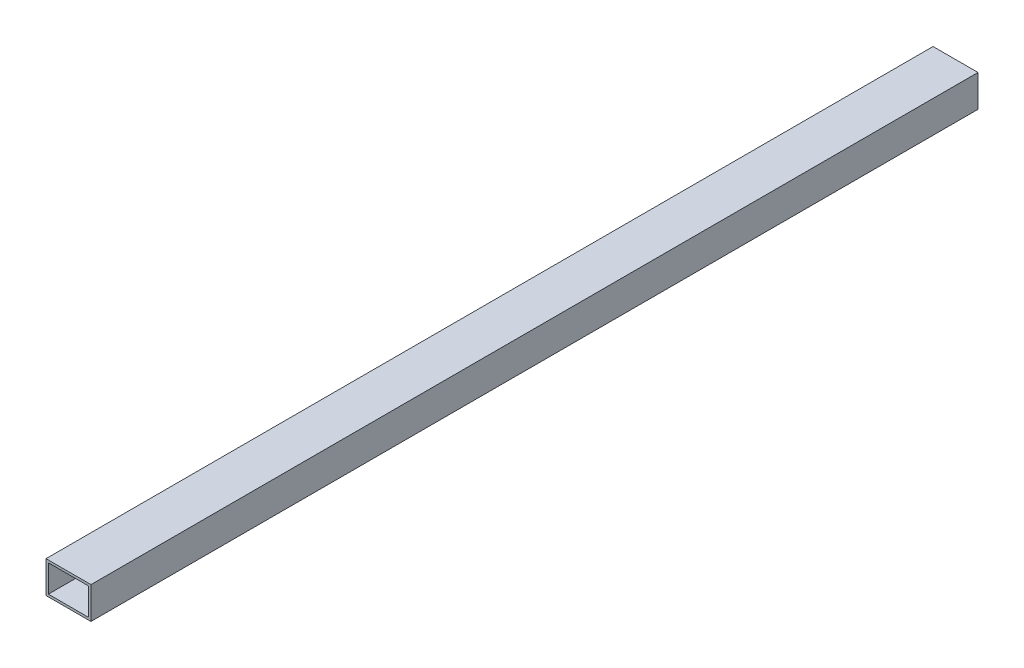
ISO-10303-21;
HEADER;
FILE_DESCRIPTION(('STEP AP214'),'2;1');
FILE_NAME('part.step','',(''),(''),'','','');
FILE_SCHEMA(('AUTOMOTIVE_DESIGN { 1 0 10303 214 1 1 1 1 }'));
ENDSEC;
DATA;
#1=APPLICATION_CONTEXT('core data for automotive mechanical design processes');
#2=APPLICATION_PROTOCOL_DEFINITION('international standard','automotive_design',2000,#1);
#3=PRODUCT_CONTEXT('',#1,'mechanical');
#4=PRODUCT('Part','Part','',(#3));
#5=PRODUCT_RELATED_PRODUCT_CATEGORY('part','',(#4));
#6=PRODUCT_DEFINITION_FORMATION('','',#4);
#7=PRODUCT_DEFINITION_CONTEXT('part definition',#1,'design');
#8=PRODUCT_DEFINITION('design','',#6,#7);
#9=PRODUCT_DEFINITION_SHAPE('','',#8);
#10=(LENGTH_UNIT() NAMED_UNIT(*) SI_UNIT(.MILLI.,.METRE.));
#11=(NAMED_UNIT(*) PLANE_ANGLE_UNIT() SI_UNIT($,.RADIAN.));
#12=(NAMED_UNIT(*) SI_UNIT($,.STERADIAN.) SOLID_ANGLE_UNIT());
#13=UNCERTAINTY_MEASURE_WITH_UNIT(LENGTH_MEASURE(1.E-05),#10,'distance_accuracy_value','');
#14=(GEOMETRIC_REPRESENTATION_CONTEXT(3) GLOBAL_UNCERTAINTY_ASSIGNED_CONTEXT((#13)) GLOBAL_UNIT_ASSIGNED_CONTEXT((#10,
#11,#12)) REPRESENTATION_CONTEXT('',''));
#15=CARTESIAN_POINT('',(0.,0.,0.));
#16=DIRECTION('',(0.,0.,1.));
#17=DIRECTION('',(1.,0.,0.));
#18=AXIS2_PLACEMENT_3D('',#15,#16,#17);
#19=CARTESIAN_POINT('',(0.,0.,750.));
#20=DIRECTION('',(0.,0.,-1.));
#21=DIRECTION('',(-1.,0.,0.));
#22=AXIS2_PLACEMENT_3D('',#19,#20,#21);
#23=PLANE('',#22);
#24=DIRECTION('',(0.,1.,0.));
#25=VECTOR('',#24,1.);
#26=CARTESIAN_POINT('',(19.,-13.5,750.));
#27=LINE('',#26,#25);
#28=CARTESIAN_POINT('',(19.,-13.5,750.));
#29=VERTEX_POINT('',#28);
#30=CARTESIAN_POINT('',(19.,13.5,750.));
#31=VERTEX_POINT('',#30);
#32=EDGE_CURVE('E137',#29,#31,#27,.T.);
#33=ORIENTED_EDGE('',*,*,#32,.T.);
#34=DIRECTION('',(-1.,0.,0.));
#35=VECTOR('',#34,1.);
#36=CARTESIAN_POINT('',(-19.,13.5,750.));
#37=LINE('',#36,#35);
#38=CARTESIAN_POINT('',(-19.,13.5,750.));
#39=VERTEX_POINT('',#38);
#40=EDGE_CURVE('E140',#31,#39,#37,.T.);
#41=ORIENTED_EDGE('',*,*,#40,.T.);
#42=DIRECTION('',(0.,-1.,0.));
#43=VECTOR('',#42,1.);
#44=CARTESIAN_POINT('',(-19.,-13.5,750.));
#45=LINE('',#44,#43);
#46=CARTESIAN_POINT('',(-19.,-13.5,750.));
#47=VERTEX_POINT('',#46);
#48=EDGE_CURVE('E143',#39,#47,#45,.T.);
#49=ORIENTED_EDGE('',*,*,#48,.T.);
#50=DIRECTION('',(1.,0.,0.));
#51=VECTOR('',#50,1.);
#52=CARTESIAN_POINT('',(-19.,-13.5,750.));
#53=LINE('',#52,#51);
#54=EDGE_CURVE('E145',#47,#29,#53,.T.);
#55=ORIENTED_EDGE('',*,*,#54,.T.);
#56=EDGE_LOOP('',(#33,#41,#49,#55));
#57=FACE_BOUND('',#56,.T.);
#58=DIRECTION('',(0.,-1.,0.));
#59=VECTOR('',#58,1.);
#60=CARTESIAN_POINT('',(-17.,-11.5,750.));
#61=LINE('',#60,#59);
#62=CARTESIAN_POINT('',(-17.,11.5,750.));
#63=VERTEX_POINT('',#62);
#64=CARTESIAN_POINT('',(-17.,-11.5,750.));
#65=VERTEX_POINT('',#64);
#66=EDGE_CURVE('E101',#63,#65,#61,.T.);
#67=ORIENTED_EDGE('',*,*,#66,.F.);
#68=DIRECTION('',(-1.,0.,0.));
#69=VECTOR('',#68,1.);
#70=CARTESIAN_POINT('',(-17.,11.5,750.));
#71=LINE('',#70,#69);
#72=CARTESIAN_POINT('',(17.,11.5,750.));
#73=VERTEX_POINT('',#72);
#74=EDGE_CURVE('E123',#73,#63,#71,.T.);
#75=ORIENTED_EDGE('',*,*,#74,.F.);
#76=DIRECTION('',(0.,1.,0.));
#77=VECTOR('',#76,1.);
#78=CARTESIAN_POINT('',(17.,-11.5,750.));
#79=LINE('',#78,#77);
#80=CARTESIAN_POINT('',(17.,-11.5,750.));
#81=VERTEX_POINT('',#80);
#82=EDGE_CURVE('E121',#81,#73,#79,.T.);
#83=ORIENTED_EDGE('',*,*,#82,.F.);
#84=DIRECTION('',(1.,0.,0.));
#85=VECTOR('',#84,1.);
#86=CARTESIAN_POINT('',(-17.,-11.5,750.));
#87=LINE('',#86,#85);
#88=EDGE_CURVE('E109',#65,#81,#87,.T.);
#89=ORIENTED_EDGE('',*,*,#88,.F.);
#90=EDGE_LOOP('',(#67,#75,#83,#89));
#91=FACE_BOUND('',#90,.T.);
#92=ADVANCED_FACE('F36',(#57,#91),#23,.F.);
#93=CARTESIAN_POINT('',(0.,0.,0.));
#94=DIRECTION('',(0.,0.,-1.));
#95=DIRECTION('',(-1.,0.,0.));
#96=AXIS2_PLACEMENT_3D('',#93,#94,#95);
#97=PLANE('',#96);
#98=DIRECTION('',(0.,1.,0.));
#99=VECTOR('',#98,1.);
#100=CARTESIAN_POINT('',(19.,-13.5,0.));
#101=LINE('',#100,#99);
#102=CARTESIAN_POINT('',(19.,-13.5,0.));
#103=VERTEX_POINT('',#102);
#104=CARTESIAN_POINT('',(19.,13.5,0.));
#105=VERTEX_POINT('',#104);
#106=EDGE_CURVE('E117',#103,#105,#101,.T.);
#107=ORIENTED_EDGE('',*,*,#106,.F.);
#108=DIRECTION('',(1.,0.,0.));
#109=VECTOR('',#108,1.);
#110=CARTESIAN_POINT('',(-19.,-13.5,0.));
#111=LINE('',#110,#109);
#112=CARTESIAN_POINT('',(-19.,-13.5,0.));
#113=VERTEX_POINT('',#112);
#114=EDGE_CURVE('E141',#113,#103,#111,.T.);
#115=ORIENTED_EDGE('',*,*,#114,.F.);
#116=DIRECTION('',(0.,-1.,0.));
#117=VECTOR('',#116,1.);
#118=CARTESIAN_POINT('',(-19.,-13.5,0.));
#119=LINE('',#118,#117);
#120=CARTESIAN_POINT('',(-19.,13.5,0.));
#121=VERTEX_POINT('',#120);
#122=EDGE_CURVE('E152',#121,#113,#119,.T.);
#123=ORIENTED_EDGE('',*,*,#122,.F.);
#124=DIRECTION('',(-1.,0.,0.));
#125=VECTOR('',#124,1.);
#126=CARTESIAN_POINT('',(-19.,13.5,0.));
#127=LINE('',#126,#125);
#128=EDGE_CURVE('E150',#105,#121,#127,.T.);
#129=ORIENTED_EDGE('',*,*,#128,.F.);
#130=EDGE_LOOP('',(#107,#115,#123,#129));
#131=FACE_BOUND('',#130,.T.);
#132=DIRECTION('',(-1.,0.,0.));
#133=VECTOR('',#132,1.);
#134=CARTESIAN_POINT('',(-17.,11.5,0.));
#135=LINE('',#134,#133);
#136=CARTESIAN_POINT('',(17.,11.5,0.));
#137=VERTEX_POINT('',#136);
#138=CARTESIAN_POINT('',(-17.,11.5,0.));
#139=VERTEX_POINT('',#138);
#140=EDGE_CURVE('E110',#137,#139,#135,.T.);
#141=ORIENTED_EDGE('',*,*,#140,.T.);
#142=DIRECTION('',(0.,-1.,0.));
#143=VECTOR('',#142,1.);
#144=CARTESIAN_POINT('',(-17.,-11.5,0.));
#145=LINE('',#144,#143);
#146=CARTESIAN_POINT('',(-17.,-11.5,0.));
#147=VERTEX_POINT('',#146);
#148=EDGE_CURVE('E59',#139,#147,#145,.T.);
#149=ORIENTED_EDGE('',*,*,#148,.T.);
#150=DIRECTION('',(1.,0.,0.));
#151=VECTOR('',#150,1.);
#152=CARTESIAN_POINT('',(-17.,-11.5,0.));
#153=LINE('',#152,#151);
#154=CARTESIAN_POINT('',(17.,-11.5,0.));
#155=VERTEX_POINT('',#154);
#156=EDGE_CURVE('E116',#147,#155,#153,.T.);
#157=ORIENTED_EDGE('',*,*,#156,.T.);
#158=DIRECTION('',(0.,1.,0.));
#159=VECTOR('',#158,1.);
#160=CARTESIAN_POINT('',(17.,-11.5,0.));
#161=LINE('',#160,#159);
#162=EDGE_CURVE('E129',#155,#137,#161,.T.);
#163=ORIENTED_EDGE('',*,*,#162,.T.);
#164=EDGE_LOOP('',(#141,#149,#157,#163));
#165=FACE_BOUND('',#164,.T.);
#166=ADVANCED_FACE('F170',(#131,#165),#97,.T.);
#167=CARTESIAN_POINT('',(19.,-13.5,750.));
#168=DIRECTION('',(-1.,0.,0.));
#169=DIRECTION('',(0.,0.,1.));
#170=AXIS2_PLACEMENT_3D('',#167,#168,#169);
#171=PLANE('',#170);
#172=ORIENTED_EDGE('',*,*,#106,.T.);
#173=DIRECTION('',(0.,0.,-1.));
#174=VECTOR('',#173,1.);
#175=CARTESIAN_POINT('',(19.,13.5,750.));
#176=LINE('',#175,#174);
#177=EDGE_CURVE('E11',#31,#105,#176,.T.);
#178=ORIENTED_EDGE('',*,*,#177,.F.);
#179=ORIENTED_EDGE('',*,*,#32,.F.);
#180=DIRECTION('',(0.,0.,-1.));
#181=VECTOR('',#180,1.);
#182=CARTESIAN_POINT('',(19.,-13.5,750.));
#183=LINE('',#182,#181);
#184=EDGE_CURVE('E147',#29,#103,#183,.T.);
#185=ORIENTED_EDGE('',*,*,#184,.T.);
#186=EDGE_LOOP('',(#172,#178,#179,#185));
#187=FACE_BOUND('',#186,.T.);
#188=ADVANCED_FACE('F38',(#187),#171,.F.);
#189=CARTESIAN_POINT('',(-19.,13.5,750.));
#190=DIRECTION('',(0.,-1.,0.));
#191=DIRECTION('',(0.,0.,-1.));
#192=AXIS2_PLACEMENT_3D('',#189,#190,#191);
#193=PLANE('',#192);
#194=ORIENTED_EDGE('',*,*,#128,.T.);
#195=DIRECTION('',(0.,0.,-1.));
#196=VECTOR('',#195,1.);
#197=CARTESIAN_POINT('',(-19.,13.5,750.));
#198=LINE('',#197,#196);
#199=EDGE_CURVE('E44',#39,#121,#198,.T.);
#200=ORIENTED_EDGE('',*,*,#199,.F.);
#201=ORIENTED_EDGE('',*,*,#40,.F.);
#202=ORIENTED_EDGE('',*,*,#177,.T.);
#203=EDGE_LOOP('',(#194,#200,#201,#202));
#204=FACE_BOUND('',#203,.T.);
#205=ADVANCED_FACE('F180',(#204),#193,.F.);
#206=CARTESIAN_POINT('',(-19.,-13.5,750.));
#207=DIRECTION('',(1.,0.,0.));
#208=DIRECTION('',(0.,0.,-1.));
#209=AXIS2_PLACEMENT_3D('',#206,#207,#208);
#210=PLANE('',#209);
#211=ORIENTED_EDGE('',*,*,#122,.T.);
#212=DIRECTION('',(0.,0.,-1.));
#213=VECTOR('',#212,1.);
#214=CARTESIAN_POINT('',(-19.,-13.5,750.));
#215=LINE('',#214,#213);
#216=EDGE_CURVE('E157',#47,#113,#215,.T.);
#217=ORIENTED_EDGE('',*,*,#216,.F.);
#218=ORIENTED_EDGE('',*,*,#48,.F.);
#219=ORIENTED_EDGE('',*,*,#199,.T.);
#220=EDGE_LOOP('',(#211,#217,#218,#219));
#221=FACE_BOUND('',#220,.T.);
#222=ADVANCED_FACE('F164',(#221),#210,.F.);
#223=CARTESIAN_POINT('',(-19.,-13.5,750.));
#224=DIRECTION('',(0.,1.,0.));
#225=DIRECTION('',(0.,0.,1.));
#226=AXIS2_PLACEMENT_3D('',#223,#224,#225);
#227=PLANE('',#226);
#228=ORIENTED_EDGE('',*,*,#114,.T.);
#229=ORIENTED_EDGE('',*,*,#184,.F.);
#230=ORIENTED_EDGE('',*,*,#54,.F.);
#231=ORIENTED_EDGE('',*,*,#216,.T.);
#232=EDGE_LOOP('',(#228,#229,#230,#231));
#233=FACE_BOUND('',#232,.T.);
#234=ADVANCED_FACE('F174',(#233),#227,.F.);
#235=CARTESIAN_POINT('',(-17.,-11.5,750.));
#236=DIRECTION('',(1.,0.,0.));
#237=DIRECTION('',(0.,0.,-1.));
#238=AXIS2_PLACEMENT_3D('',#235,#236,#237);
#239=PLANE('',#238);
#240=ORIENTED_EDGE('',*,*,#148,.F.);
#241=DIRECTION('',(0.,0.,-1.));
#242=VECTOR('',#241,1.);
#243=CARTESIAN_POINT('',(-17.,11.5,750.));
#244=LINE('',#243,#242);
#245=EDGE_CURVE('E105',#63,#139,#244,.T.);
#246=ORIENTED_EDGE('',*,*,#245,.F.);
#247=ORIENTED_EDGE('',*,*,#66,.T.);
#248=DIRECTION('',(0.,0.,-1.));
#249=VECTOR('',#248,1.);
#250=CARTESIAN_POINT('',(-17.,-11.5,750.));
#251=LINE('',#250,#249);
#252=EDGE_CURVE('E104',#65,#147,#251,.T.);
#253=ORIENTED_EDGE('',*,*,#252,.T.);
#254=EDGE_LOOP('',(#240,#246,#247,#253));
#255=FACE_BOUND('',#254,.T.);
#256=ADVANCED_FACE('F103',(#255),#239,.T.);
#257=CARTESIAN_POINT('',(-17.,-11.5,750.));
#258=DIRECTION('',(0.,1.,0.));
#259=DIRECTION('',(0.,0.,1.));
#260=AXIS2_PLACEMENT_3D('',#257,#258,#259);
#261=PLANE('',#260);
#262=ORIENTED_EDGE('',*,*,#156,.F.);
#263=ORIENTED_EDGE('',*,*,#252,.F.);
#264=ORIENTED_EDGE('',*,*,#88,.T.);
#265=DIRECTION('',(0.,0.,-1.));
#266=VECTOR('',#265,1.);
#267=CARTESIAN_POINT('',(17.,-11.5,750.));
#268=LINE('',#267,#266);
#269=EDGE_CURVE('E118',#81,#155,#268,.T.);
#270=ORIENTED_EDGE('',*,*,#269,.T.);
#271=EDGE_LOOP('',(#262,#263,#264,#270));
#272=FACE_BOUND('',#271,.T.);
#273=ADVANCED_FACE('F113',(#272),#261,.T.);
#274=CARTESIAN_POINT('',(17.,-11.5,750.));
#275=DIRECTION('',(-1.,0.,0.));
#276=DIRECTION('',(0.,0.,1.));
#277=AXIS2_PLACEMENT_3D('',#274,#275,#276);
#278=PLANE('',#277);
#279=ORIENTED_EDGE('',*,*,#162,.F.);
#280=ORIENTED_EDGE('',*,*,#269,.F.);
#281=ORIENTED_EDGE('',*,*,#82,.T.);
#282=DIRECTION('',(0.,0.,-1.));
#283=VECTOR('',#282,1.);
#284=CARTESIAN_POINT('',(17.,11.5,750.));
#285=LINE('',#284,#283);
#286=EDGE_CURVE('E51',#73,#137,#285,.T.);
#287=ORIENTED_EDGE('',*,*,#286,.T.);
#288=EDGE_LOOP('',(#279,#280,#281,#287));
#289=FACE_BOUND('',#288,.T.);
#290=ADVANCED_FACE('F203',(#289),#278,.T.);
#291=CARTESIAN_POINT('',(-17.,11.5,750.));
#292=DIRECTION('',(0.,-1.,0.));
#293=DIRECTION('',(0.,0.,-1.));
#294=AXIS2_PLACEMENT_3D('',#291,#292,#293);
#295=PLANE('',#294);
#296=ORIENTED_EDGE('',*,*,#140,.F.);
#297=ORIENTED_EDGE('',*,*,#286,.F.);
#298=ORIENTED_EDGE('',*,*,#74,.T.);
#299=ORIENTED_EDGE('',*,*,#245,.T.);
#300=EDGE_LOOP('',(#296,#297,#298,#299));
#301=FACE_BOUND('',#300,.T.);
#302=ADVANCED_FACE('F207',(#301),#295,.T.);
#303=CLOSED_SHELL('',(#92,#166,#188,#205,#222,#234,#256,#273,#290,#302));
#304=MANIFOLD_SOLID_BREP('B2',#303);
#305=ADVANCED_BREP_SHAPE_REPRESENTATION('',(#18,#304),#14);
#306=SHAPE_DEFINITION_REPRESENTATION(#9,#305);
ENDSEC;
END-ISO-10303-21;
